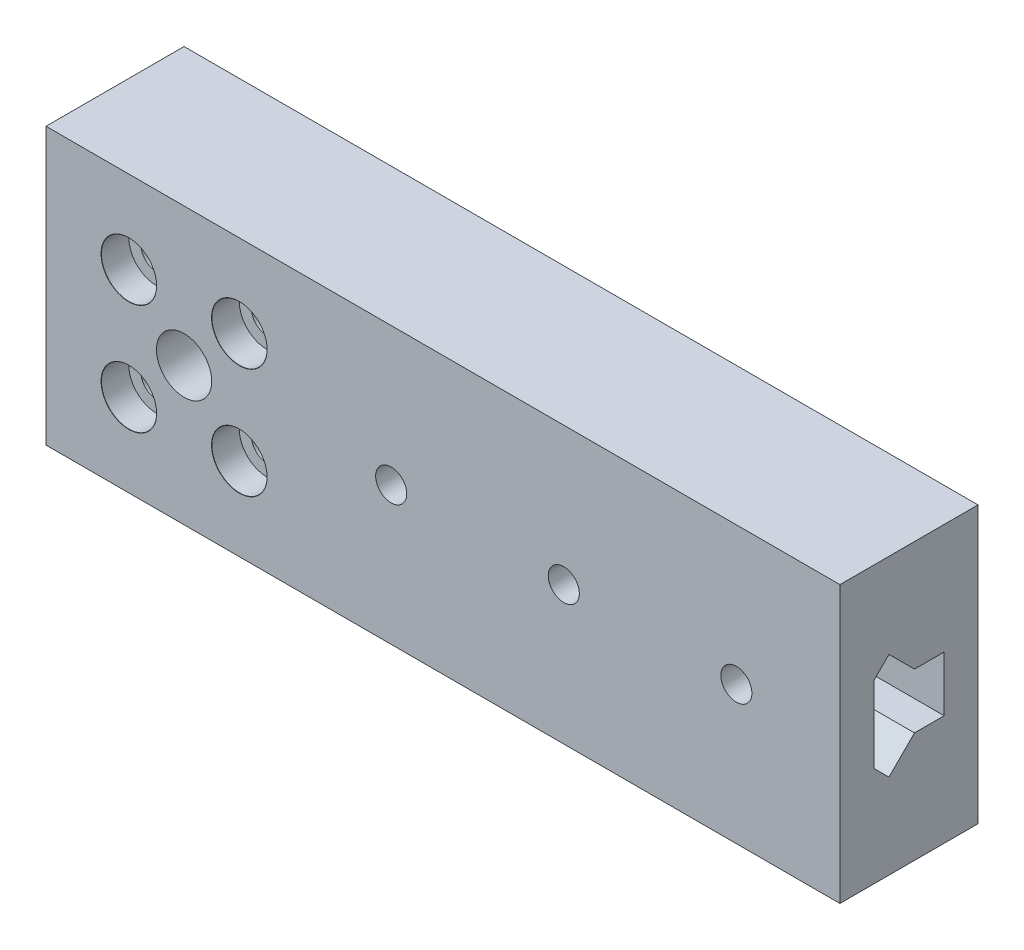
ISO-10303-21;
HEADER;
FILE_DESCRIPTION(('STEP AP214'),'2;1');
FILE_NAME('part.step','',(''),(''),'','','');
FILE_SCHEMA(('AUTOMOTIVE_DESIGN { 1 0 10303 214 1 1 1 1 }'));
ENDSEC;
DATA;
#1=APPLICATION_CONTEXT('core data for automotive mechanical design processes');
#2=APPLICATION_PROTOCOL_DEFINITION('international standard','automotive_design',2000,#1);
#3=PRODUCT_CONTEXT('',#1,'mechanical');
#4=PRODUCT('Part','Part','',(#3));
#5=PRODUCT_RELATED_PRODUCT_CATEGORY('part','',(#4));
#6=PRODUCT_DEFINITION_FORMATION('','',#4);
#7=PRODUCT_DEFINITION_CONTEXT('part definition',#1,'design');
#8=PRODUCT_DEFINITION('design','',#6,#7);
#9=PRODUCT_DEFINITION_SHAPE('','',#8);
#10=(LENGTH_UNIT() NAMED_UNIT(*) SI_UNIT(.MILLI.,.METRE.));
#11=(NAMED_UNIT(*) PLANE_ANGLE_UNIT() SI_UNIT($,.RADIAN.));
#12=(NAMED_UNIT(*) SI_UNIT($,.STERADIAN.) SOLID_ANGLE_UNIT());
#13=UNCERTAINTY_MEASURE_WITH_UNIT(LENGTH_MEASURE(1.E-05),#10,'distance_accuracy_value','');
#14=(GEOMETRIC_REPRESENTATION_CONTEXT(3) GLOBAL_UNCERTAINTY_ASSIGNED_CONTEXT((#13)) GLOBAL_UNIT_ASSIGNED_CONTEXT((#10,
#11,#12)) REPRESENTATION_CONTEXT('',''));
#15=CARTESIAN_POINT('',(0.,0.,0.));
#16=DIRECTION('',(0.,0.,1.));
#17=DIRECTION('',(1.,0.,0.));
#18=AXIS2_PLACEMENT_3D('',#15,#16,#17);
#19=CARTESIAN_POINT('',(75.,-20.,10.));
#20=DIRECTION('',(-1.,0.,0.));
#21=DIRECTION('',(0.,0.,1.));
#22=AXIS2_PLACEMENT_3D('',#19,#20,#21);
#23=PLANE('',#22);
#24=DIRECTION('',(0.,1.,0.));
#25=VECTOR('',#24,1.);
#26=CARTESIAN_POINT('',(75.,-20.,-10.));
#27=LINE('',#26,#25);
#28=CARTESIAN_POINT('',(75.,-20.,-10.));
#29=VERTEX_POINT('',#28);
#30=CARTESIAN_POINT('',(75.,20.,-10.));
#31=VERTEX_POINT('',#30);
#32=EDGE_CURVE('E84',#29,#31,#27,.T.);
#33=ORIENTED_EDGE('',*,*,#32,.T.);
#34=DIRECTION('',(0.,0.,-1.));
#35=VECTOR('',#34,1.);
#36=CARTESIAN_POINT('',(75.,20.,10.));
#37=LINE('',#36,#35);
#38=CARTESIAN_POINT('',(75.,20.,10.));
#39=VERTEX_POINT('',#38);
#40=EDGE_CURVE('E338',#39,#31,#37,.T.);
#41=ORIENTED_EDGE('',*,*,#40,.F.);
#42=DIRECTION('',(0.,1.,0.));
#43=VECTOR('',#42,1.);
#44=CARTESIAN_POINT('',(75.,-20.,10.));
#45=LINE('',#44,#43);
#46=CARTESIAN_POINT('',(75.,-20.,10.));
#47=VERTEX_POINT('',#46);
#48=EDGE_CURVE('E60',#47,#39,#45,.T.);
#49=ORIENTED_EDGE('',*,*,#48,.F.);
#50=DIRECTION('',(0.,0.,-1.));
#51=VECTOR('',#50,1.);
#52=CARTESIAN_POINT('',(75.,-20.,10.));
#53=LINE('',#52,#51);
#54=EDGE_CURVE('E351',#47,#29,#53,.T.);
#55=ORIENTED_EDGE('',*,*,#54,.T.);
#56=EDGE_LOOP('',(#33,#41,#49,#55));
#57=FACE_BOUND('',#56,.T.);
#58=DIRECTION('',(0.,0.707106781186546,0.707106781186549));
#59=VECTOR('',#58,1.);
#60=CARTESIAN_POINT('',(75.,-5.5,5.1));
#61=LINE('',#60,#59);
#62=CARTESIAN_POINT('',(75.,-7.69999999999999,2.9));
#63=VERTEX_POINT('',#62);
#64=CARTESIAN_POINT('',(75.,-5.5,5.1));
#65=VERTEX_POINT('',#64);
#66=EDGE_CURVE('E161',#63,#65,#61,.T.);
#67=ORIENTED_EDGE('',*,*,#66,.T.);
#68=DIRECTION('',(0.,-1.,0.));
#69=VECTOR('',#68,1.);
#70=CARTESIAN_POINT('',(75.,0.,5.1));
#71=LINE('',#70,#69);
#72=CARTESIAN_POINT('',(75.,5.5,5.1));
#73=VERTEX_POINT('',#72);
#74=EDGE_CURVE('E142',#73,#65,#71,.T.);
#75=ORIENTED_EDGE('',*,*,#74,.F.);
#76=DIRECTION('',(0.,-0.707106781186546,0.707106781186549));
#77=VECTOR('',#76,1.);
#78=CARTESIAN_POINT('',(75.,5.5,5.1));
#79=LINE('',#78,#77);
#80=CARTESIAN_POINT('',(75.,7.69999999999999,2.9));
#81=VERTEX_POINT('',#80);
#82=EDGE_CURVE('E154',#81,#73,#79,.T.);
#83=ORIENTED_EDGE('',*,*,#82,.F.);
#84=DIRECTION('',(0.,0.707106781186549,0.707106781186546));
#85=VECTOR('',#84,1.);
#86=CARTESIAN_POINT('',(75.,7.69999999999999,2.9));
#87=LINE('',#86,#85);
#88=CARTESIAN_POINT('',(75.,4.,-0.799999999999975));
#89=VERTEX_POINT('',#88);
#90=EDGE_CURVE('E217',#89,#81,#87,.T.);
#91=ORIENTED_EDGE('',*,*,#90,.F.);
#92=DIRECTION('',(0.,0.,1.));
#93=VECTOR('',#92,1.);
#94=CARTESIAN_POINT('',(75.,4.,-0.799999999999975));
#95=LINE('',#94,#93);
#96=CARTESIAN_POINT('',(75.,4.,-5.1));
#97=VERTEX_POINT('',#96);
#98=EDGE_CURVE('E213',#97,#89,#95,.T.);
#99=ORIENTED_EDGE('',*,*,#98,.F.);
#100=DIRECTION('',(0.,1.,0.));
#101=VECTOR('',#100,1.);
#102=CARTESIAN_POINT('',(75.,4.,-5.1));
#103=LINE('',#102,#101);
#104=CARTESIAN_POINT('',(75.,-4.,-5.1));
#105=VERTEX_POINT('',#104);
#106=EDGE_CURVE('E209',#105,#97,#103,.T.);
#107=ORIENTED_EDGE('',*,*,#106,.F.);
#108=DIRECTION('',(0.,0.,1.));
#109=VECTOR('',#108,1.);
#110=CARTESIAN_POINT('',(75.,-4.,-0.799999999999975));
#111=LINE('',#110,#109);
#112=CARTESIAN_POINT('',(75.,-4.,-0.799999999999975));
#113=VERTEX_POINT('',#112);
#114=EDGE_CURVE('E167',#105,#113,#111,.T.);
#115=ORIENTED_EDGE('',*,*,#114,.T.);
#116=DIRECTION('',(0.,-0.707106781186549,0.707106781186546));
#117=VECTOR('',#116,1.);
#118=CARTESIAN_POINT('',(75.,-7.69999999999999,2.9));
#119=LINE('',#118,#117);
#120=EDGE_CURVE('E171',#113,#63,#119,.T.);
#121=ORIENTED_EDGE('',*,*,#120,.T.);
#122=EDGE_LOOP('',(#67,#75,#83,#91,#99,#107,#115,#121));
#123=FACE_BOUND('',#122,.T.);
#124=ADVANCED_FACE('F41',(#57,#123),#23,.F.);
#125=CARTESIAN_POINT('',(0.,0.,10.));
#126=DIRECTION('',(0.,0.,1.));
#127=DIRECTION('',(1.,0.,0.));
#128=AXIS2_PLACEMENT_3D('',#125,#126,#127);
#129=PLANE('',#128);
#130=CARTESIAN_POINT('',(10.,0.,10.));
#131=DIRECTION('',(0.,0.,-1.));
#132=DIRECTION('',(-1.,0.,0.));
#133=AXIS2_PLACEMENT_3D('',#130,#131,#132);
#134=CIRCLE('',#133,2.25);
#135=CARTESIAN_POINT('',(7.75000000000001,0.,10.));
#136=VERTEX_POINT('',#135);
#137=EDGE_CURVE('E552',#136,#136,#134,.T.);
#138=ORIENTED_EDGE('',*,*,#137,.T.);
#139=EDGE_LOOP('',(#138));
#140=FACE_BOUND('',#139,.T.);
#141=CARTESIAN_POINT('',(35.,0.,10.));
#142=DIRECTION('',(0.,0.,-1.));
#143=DIRECTION('',(-1.,0.,0.));
#144=AXIS2_PLACEMENT_3D('',#141,#142,#143);
#145=CIRCLE('',#144,2.25);
#146=CARTESIAN_POINT('',(32.75,0.,10.));
#147=VERTEX_POINT('',#146);
#148=EDGE_CURVE('E561',#147,#147,#145,.T.);
#149=ORIENTED_EDGE('',*,*,#148,.T.);
#150=EDGE_LOOP('',(#149));
#151=FACE_BOUND('',#150,.T.);
#152=CARTESIAN_POINT('',(60.,0.,10.));
#153=DIRECTION('',(0.,0.,-1.));
#154=DIRECTION('',(-1.,0.,0.));
#155=AXIS2_PLACEMENT_3D('',#152,#153,#154);
#156=CIRCLE('',#155,2.25);
#157=CARTESIAN_POINT('',(57.75,0.,10.));
#158=VERTEX_POINT('',#157);
#159=EDGE_CURVE('E580',#158,#158,#156,.T.);
#160=ORIENTED_EDGE('',*,*,#159,.T.);
#161=EDGE_LOOP('',(#160));
#162=FACE_BOUND('',#161,.T.);
#163=CARTESIAN_POINT('',(-28.,8.,10.));
#164=DIRECTION('',(0.,0.,1.));
#165=DIRECTION('',(1.,0.,0.));
#166=AXIS2_PLACEMENT_3D('',#163,#164,#165);
#167=CIRCLE('',#166,4.025);
#168=CARTESIAN_POINT('',(-23.975,8.,10.));
#169=VERTEX_POINT('',#168);
#170=EDGE_CURVE('E259',#169,#169,#167,.T.);
#171=ORIENTED_EDGE('',*,*,#170,.F.);
#172=EDGE_LOOP('',(#171));
#173=FACE_BOUND('',#172,.T.);
#174=CARTESIAN_POINT('',(-12.,8.,10.));
#175=DIRECTION('',(0.,0.,1.));
#176=DIRECTION('',(1.,0.,0.));
#177=AXIS2_PLACEMENT_3D('',#174,#175,#176);
#178=CIRCLE('',#177,4.025);
#179=CARTESIAN_POINT('',(-7.975,8.,10.));
#180=VERTEX_POINT('',#179);
#181=EDGE_CURVE('E275',#180,#180,#178,.T.);
#182=ORIENTED_EDGE('',*,*,#181,.F.);
#183=EDGE_LOOP('',(#182));
#184=FACE_BOUND('',#183,.T.);
#185=CARTESIAN_POINT('',(-28.,-8.,10.));
#186=DIRECTION('',(0.,0.,1.));
#187=DIRECTION('',(1.,0.,0.));
#188=AXIS2_PLACEMENT_3D('',#185,#186,#187);
#189=CIRCLE('',#188,4.025);
#190=CARTESIAN_POINT('',(-23.975,-8.,10.));
#191=VERTEX_POINT('',#190);
#192=EDGE_CURVE('E291',#191,#191,#189,.T.);
#193=ORIENTED_EDGE('',*,*,#192,.F.);
#194=EDGE_LOOP('',(#193));
#195=FACE_BOUND('',#194,.T.);
#196=CARTESIAN_POINT('',(-12.,-8.,10.));
#197=DIRECTION('',(0.,0.,1.));
#198=DIRECTION('',(1.,0.,0.));
#199=AXIS2_PLACEMENT_3D('',#196,#197,#198);
#200=CIRCLE('',#199,4.025);
#201=CARTESIAN_POINT('',(-7.975,-8.,10.));
#202=VERTEX_POINT('',#201);
#203=EDGE_CURVE('E307',#202,#202,#200,.T.);
#204=ORIENTED_EDGE('',*,*,#203,.F.);
#205=EDGE_LOOP('',(#204));
#206=FACE_BOUND('',#205,.T.);
#207=DIRECTION('',(-1.,0.,0.));
#208=VECTOR('',#207,1.);
#209=CARTESIAN_POINT('',(75.,20.,10.));
#210=LINE('',#209,#208);
#211=CARTESIAN_POINT('',(-40.,20.,10.));
#212=VERTEX_POINT('',#211);
#213=EDGE_CURVE('E328',#39,#212,#210,.T.);
#214=ORIENTED_EDGE('',*,*,#213,.T.);
#215=DIRECTION('',(0.,-1.,0.));
#216=VECTOR('',#215,1.);
#217=CARTESIAN_POINT('',(-40.,20.,10.));
#218=LINE('',#217,#216);
#219=CARTESIAN_POINT('',(-40.,-20.,10.));
#220=VERTEX_POINT('',#219);
#221=EDGE_CURVE('E91',#212,#220,#218,.T.);
#222=ORIENTED_EDGE('',*,*,#221,.T.);
#223=DIRECTION('',(1.,0.,0.));
#224=VECTOR('',#223,1.);
#225=CARTESIAN_POINT('',(-40.,-20.,10.));
#226=LINE('',#225,#224);
#227=EDGE_CURVE('E333',#220,#47,#226,.T.);
#228=ORIENTED_EDGE('',*,*,#227,.T.);
#229=ORIENTED_EDGE('',*,*,#48,.T.);
#230=EDGE_LOOP('',(#214,#222,#228,#229));
#231=FACE_BOUND('',#230,.T.);
#232=CARTESIAN_POINT('',(-20.,0.,10.));
#233=DIRECTION('',(0.,0.,1.));
#234=DIRECTION('',(1.,0.,0.));
#235=AXIS2_PLACEMENT_3D('',#232,#233,#234);
#236=CIRCLE('',#235,4.);
#237=CARTESIAN_POINT('',(-16.,0.,10.));
#238=VERTEX_POINT('',#237);
#239=EDGE_CURVE('E323',#238,#238,#236,.T.);
#240=ORIENTED_EDGE('',*,*,#239,.F.);
#241=EDGE_LOOP('',(#240));
#242=FACE_BOUND('',#241,.T.);
#243=ADVANCED_FACE('F364',(#140,#151,#162,#173,#184,#195,#206,#231,#242),#129,.T.);
#244=CARTESIAN_POINT('',(0.,0.,-10.));
#245=DIRECTION('',(0.,0.,1.));
#246=DIRECTION('',(1.,0.,0.));
#247=AXIS2_PLACEMENT_3D('',#244,#245,#246);
#248=PLANE('',#247);
#249=CARTESIAN_POINT('',(10.,0.,-10.));
#250=DIRECTION('',(0.,0.,-1.));
#251=DIRECTION('',(-1.,0.,0.));
#252=AXIS2_PLACEMENT_3D('',#249,#250,#251);
#253=CIRCLE('',#252,2.25);
#254=CARTESIAN_POINT('',(7.75,0.,-10.));
#255=VERTEX_POINT('',#254);
#256=EDGE_CURVE('E389',#255,#255,#253,.T.);
#257=ORIENTED_EDGE('',*,*,#256,.F.);
#258=EDGE_LOOP('',(#257));
#259=FACE_BOUND('',#258,.T.);
#260=CARTESIAN_POINT('',(35.,0.,-10.));
#261=DIRECTION('',(0.,0.,-1.));
#262=DIRECTION('',(-1.,0.,0.));
#263=AXIS2_PLACEMENT_3D('',#260,#261,#262);
#264=CIRCLE('',#263,2.25);
#265=CARTESIAN_POINT('',(32.75,0.,-10.));
#266=VERTEX_POINT('',#265);
#267=EDGE_CURVE('E393',#266,#266,#264,.T.);
#268=ORIENTED_EDGE('',*,*,#267,.F.);
#269=EDGE_LOOP('',(#268));
#270=FACE_BOUND('',#269,.T.);
#271=CARTESIAN_POINT('',(60.,0.,-10.));
#272=DIRECTION('',(0.,0.,-1.));
#273=DIRECTION('',(-1.,0.,0.));
#274=AXIS2_PLACEMENT_3D('',#271,#272,#273);
#275=CIRCLE('',#274,2.25);
#276=CARTESIAN_POINT('',(57.75,0.,-10.));
#277=VERTEX_POINT('',#276);
#278=EDGE_CURVE('E397',#277,#277,#275,.T.);
#279=ORIENTED_EDGE('',*,*,#278,.F.);
#280=EDGE_LOOP('',(#279));
#281=FACE_BOUND('',#280,.T.);
#282=CARTESIAN_POINT('',(-20.,0.,-10.));
#283=DIRECTION('',(0.,0.,-1.));
#284=DIRECTION('',(-1.,0.,0.));
#285=AXIS2_PLACEMENT_3D('',#282,#283,#284);
#286=CIRCLE('',#285,16.5);
#287=CARTESIAN_POINT('',(-36.5,0.,-10.));
#288=VERTEX_POINT('',#287);
#289=EDGE_CURVE('E236',#288,#288,#286,.T.);
#290=ORIENTED_EDGE('',*,*,#289,.F.);
#291=EDGE_LOOP('',(#290));
#292=FACE_BOUND('',#291,.T.);
#293=DIRECTION('',(-1.,0.,0.));
#294=VECTOR('',#293,1.);
#295=CARTESIAN_POINT('',(75.,20.,-10.));
#296=LINE('',#295,#294);
#297=CARTESIAN_POINT('',(-40.,20.,-10.));
#298=VERTEX_POINT('',#297);
#299=EDGE_CURVE('E327',#31,#298,#296,.T.);
#300=ORIENTED_EDGE('',*,*,#299,.F.);
#301=ORIENTED_EDGE('',*,*,#32,.F.);
#302=DIRECTION('',(1.,0.,0.));
#303=VECTOR('',#302,1.);
#304=CARTESIAN_POINT('',(-40.,-20.,-10.));
#305=LINE('',#304,#303);
#306=CARTESIAN_POINT('',(-40.,-20.,-10.));
#307=VERTEX_POINT('',#306);
#308=EDGE_CURVE('E78',#307,#29,#305,.T.);
#309=ORIENTED_EDGE('',*,*,#308,.F.);
#310=DIRECTION('',(0.,-1.,0.));
#311=VECTOR('',#310,1.);
#312=CARTESIAN_POINT('',(-40.,20.,-10.));
#313=LINE('',#312,#311);
#314=EDGE_CURVE('E342',#298,#307,#313,.T.);
#315=ORIENTED_EDGE('',*,*,#314,.F.);
#316=EDGE_LOOP('',(#300,#301,#309,#315));
#317=FACE_BOUND('',#316,.T.);
#318=ADVANCED_FACE('F359',(#259,#270,#281,#292,#317),#248,.F.);
#319=CARTESIAN_POINT('',(75.,20.,10.));
#320=DIRECTION('',(0.,-1.,0.));
#321=DIRECTION('',(0.,0.,-1.));
#322=AXIS2_PLACEMENT_3D('',#319,#320,#321);
#323=PLANE('',#322);
#324=ORIENTED_EDGE('',*,*,#299,.T.);
#325=DIRECTION('',(0.,0.,-1.));
#326=VECTOR('',#325,1.);
#327=CARTESIAN_POINT('',(-40.,20.,10.));
#328=LINE('',#327,#326);
#329=EDGE_CURVE('E12',#212,#298,#328,.T.);
#330=ORIENTED_EDGE('',*,*,#329,.F.);
#331=ORIENTED_EDGE('',*,*,#213,.F.);
#332=ORIENTED_EDGE('',*,*,#40,.T.);
#333=EDGE_LOOP('',(#324,#330,#331,#332));
#334=FACE_BOUND('',#333,.T.);
#335=ADVANCED_FACE('F43',(#334),#323,.F.);
#336=CARTESIAN_POINT('',(-40.,20.,10.));
#337=DIRECTION('',(1.,0.,0.));
#338=DIRECTION('',(0.,0.,-1.));
#339=AXIS2_PLACEMENT_3D('',#336,#337,#338);
#340=PLANE('',#339);
#341=ORIENTED_EDGE('',*,*,#314,.T.);
#342=DIRECTION('',(0.,0.,-1.));
#343=VECTOR('',#342,1.);
#344=CARTESIAN_POINT('',(-40.,-20.,10.));
#345=LINE('',#344,#343);
#346=EDGE_CURVE('E52',#220,#307,#345,.T.);
#347=ORIENTED_EDGE('',*,*,#346,.F.);
#348=ORIENTED_EDGE('',*,*,#221,.F.);
#349=ORIENTED_EDGE('',*,*,#329,.T.);
#350=EDGE_LOOP('',(#341,#347,#348,#349));
#351=FACE_BOUND('',#350,.T.);
#352=ADVANCED_FACE('F375',(#351),#340,.F.);
#353=CARTESIAN_POINT('',(-40.,-20.,10.));
#354=DIRECTION('',(0.,1.,0.));
#355=DIRECTION('',(0.,0.,1.));
#356=AXIS2_PLACEMENT_3D('',#353,#354,#355);
#357=PLANE('',#356);
#358=ORIENTED_EDGE('',*,*,#308,.T.);
#359=ORIENTED_EDGE('',*,*,#54,.F.);
#360=ORIENTED_EDGE('',*,*,#227,.F.);
#361=ORIENTED_EDGE('',*,*,#346,.T.);
#362=EDGE_LOOP('',(#358,#359,#360,#361));
#363=FACE_BOUND('',#362,.T.);
#364=ADVANCED_FACE('F356',(#363),#357,.F.);
#365=CARTESIAN_POINT('',(-20.,0.,10.));
#366=DIRECTION('',(0.,0.,-1.));
#367=DIRECTION('',(-1.,0.,0.));
#368=AXIS2_PLACEMENT_3D('',#365,#366,#367);
#369=CYLINDRICAL_SURFACE('',#368,4.);
#370=CARTESIAN_POINT('',(-20.,0.,2.));
#371=DIRECTION('',(0.,0.,1.));
#372=DIRECTION('',(1.,0.,0.));
#373=AXIS2_PLACEMENT_3D('',#370,#371,#372);
#374=CIRCLE('',#373,4.);
#375=CARTESIAN_POINT('',(-16.,0.,2.));
#376=VERTEX_POINT('',#375);
#377=EDGE_CURVE('E240',#376,#376,#374,.F.);
#378=ORIENTED_EDGE('',*,*,#377,.T.);
#379=EDGE_LOOP('',(#378));
#380=FACE_BOUND('',#379,.T.);
#381=ORIENTED_EDGE('',*,*,#239,.T.);
#382=EDGE_LOOP('',(#381));
#383=FACE_BOUND('',#382,.T.);
#384=ADVANCED_FACE('F374',(#380,#383),#369,.F.);
#385=CARTESIAN_POINT('',(-12.,-8.,10.));
#386=DIRECTION('',(0.,0.,1.));
#387=DIRECTION('',(1.,0.,0.));
#388=AXIS2_PLACEMENT_3D('',#385,#386,#387);
#389=CYLINDRICAL_SURFACE('',#388,2.25);
#390=CARTESIAN_POINT('',(-12.,-8.,2.));
#391=DIRECTION('',(0.,0.,1.));
#392=DIRECTION('',(1.,0.,0.));
#393=AXIS2_PLACEMENT_3D('',#390,#391,#392);
#394=CIRCLE('',#393,2.25);
#395=CARTESIAN_POINT('',(-9.75,-8.,2.));
#396=VERTEX_POINT('',#395);
#397=EDGE_CURVE('E255',#396,#396,#394,.F.);
#398=ORIENTED_EDGE('',*,*,#397,.T.);
#399=EDGE_LOOP('',(#398));
#400=FACE_BOUND('',#399,.T.);
#401=CARTESIAN_POINT('',(-12.,-8.,6.));
#402=DIRECTION('',(0.,0.,1.));
#403=DIRECTION('',(1.,0.,0.));
#404=AXIS2_PLACEMENT_3D('',#401,#402,#403);
#405=CIRCLE('',#404,2.25);
#406=CARTESIAN_POINT('',(-9.74999999999999,-8.,6.));
#407=VERTEX_POINT('',#406);
#408=EDGE_CURVE('E319',#407,#407,#405,.T.);
#409=ORIENTED_EDGE('',*,*,#408,.T.);
#410=EDGE_LOOP('',(#409));
#411=FACE_BOUND('',#410,.T.);
#412=ADVANCED_FACE('F418',(#400,#411),#389,.F.);
#413=CARTESIAN_POINT('',(-8.,-8.,6.));
#414=DIRECTION('',(0.,0.,-1.));
#415=DIRECTION('',(-1.,0.,0.));
#416=AXIS2_PLACEMENT_3D('',#413,#414,#415);
#417=PLANE('',#416);
#418=ORIENTED_EDGE('',*,*,#408,.F.);
#419=EDGE_LOOP('',(#418));
#420=FACE_BOUND('',#419,.T.);
#421=CARTESIAN_POINT('',(-12.,-8.,6.));
#422=DIRECTION('',(0.,0.,1.));
#423=DIRECTION('',(1.,0.,0.));
#424=AXIS2_PLACEMENT_3D('',#421,#422,#423);
#425=CIRCLE('',#424,4.);
#426=CARTESIAN_POINT('',(-8.,-8.,6.));
#427=VERTEX_POINT('',#426);
#428=EDGE_CURVE('E315',#427,#427,#425,.T.);
#429=ORIENTED_EDGE('',*,*,#428,.T.);
#430=EDGE_LOOP('',(#429));
#431=FACE_BOUND('',#430,.T.);
#432=ADVANCED_FACE('F421',(#420,#431),#417,.F.);
#433=CARTESIAN_POINT('',(-12.,-8.,10.));
#434=DIRECTION('',(0.,0.,1.));
#435=DIRECTION('',(1.,0.,0.));
#436=AXIS2_PLACEMENT_3D('',#433,#434,#435);
#437=CYLINDRICAL_SURFACE('',#436,4.);
#438=ORIENTED_EDGE('',*,*,#428,.F.);
#439=EDGE_LOOP('',(#438));
#440=FACE_BOUND('',#439,.T.);
#441=CARTESIAN_POINT('',(-12.,-8.,9.975));
#442=DIRECTION('',(0.,0.,1.));
#443=DIRECTION('',(1.,0.,0.));
#444=AXIS2_PLACEMENT_3D('',#441,#442,#443);
#445=CIRCLE('',#444,4.);
#446=CARTESIAN_POINT('',(-8.,-8.,9.975));
#447=VERTEX_POINT('',#446);
#448=EDGE_CURVE('E311',#447,#447,#445,.T.);
#449=ORIENTED_EDGE('',*,*,#448,.T.);
#450=EDGE_LOOP('',(#449));
#451=FACE_BOUND('',#450,.T.);
#452=ADVANCED_FACE('F427',(#440,#451),#437,.F.);
#453=CARTESIAN_POINT('',(-12.,-8.,10.));
#454=DIRECTION('',(0.,0.,1.));
#455=DIRECTION('',(1.,0.,0.));
#456=AXIS2_PLACEMENT_3D('',#453,#454,#455);
#457=CONICAL_SURFACE('',#456,4.025,0.785398163397448);
#458=ORIENTED_EDGE('',*,*,#448,.F.);
#459=EDGE_LOOP('',(#458));
#460=FACE_BOUND('',#459,.T.);
#461=ORIENTED_EDGE('',*,*,#203,.T.);
#462=EDGE_LOOP('',(#461));
#463=FACE_BOUND('',#462,.T.);
#464=ADVANCED_FACE('F433',(#460,#463),#457,.F.);
#465=CARTESIAN_POINT('',(-28.,-8.,10.));
#466=DIRECTION('',(0.,0.,1.));
#467=DIRECTION('',(1.,0.,0.));
#468=AXIS2_PLACEMENT_3D('',#465,#466,#467);
#469=CYLINDRICAL_SURFACE('',#468,2.25);
#470=CARTESIAN_POINT('',(-28.,-8.,2.));
#471=DIRECTION('',(0.,0.,1.));
#472=DIRECTION('',(1.,0.,0.));
#473=AXIS2_PLACEMENT_3D('',#470,#471,#472);
#474=CIRCLE('',#473,2.25);
#475=CARTESIAN_POINT('',(-25.75,-8.,2.));
#476=VERTEX_POINT('',#475);
#477=EDGE_CURVE('E251',#476,#476,#474,.F.);
#478=ORIENTED_EDGE('',*,*,#477,.T.);
#479=EDGE_LOOP('',(#478));
#480=FACE_BOUND('',#479,.T.);
#481=CARTESIAN_POINT('',(-28.,-8.,6.));
#482=DIRECTION('',(0.,0.,1.));
#483=DIRECTION('',(1.,0.,0.));
#484=AXIS2_PLACEMENT_3D('',#481,#482,#483);
#485=CIRCLE('',#484,2.25);
#486=CARTESIAN_POINT('',(-25.75,-8.,6.));
#487=VERTEX_POINT('',#486);
#488=EDGE_CURVE('E303',#487,#487,#485,.T.);
#489=ORIENTED_EDGE('',*,*,#488,.T.);
#490=EDGE_LOOP('',(#489));
#491=FACE_BOUND('',#490,.T.);
#492=ADVANCED_FACE('F439',(#480,#491),#469,.F.);
#493=CARTESIAN_POINT('',(-24.,-8.,6.));
#494=DIRECTION('',(0.,0.,-1.));
#495=DIRECTION('',(-1.,0.,0.));
#496=AXIS2_PLACEMENT_3D('',#493,#494,#495);
#497=PLANE('',#496);
#498=ORIENTED_EDGE('',*,*,#488,.F.);
#499=EDGE_LOOP('',(#498));
#500=FACE_BOUND('',#499,.T.);
#501=CARTESIAN_POINT('',(-28.,-8.,6.));
#502=DIRECTION('',(0.,0.,1.));
#503=DIRECTION('',(1.,0.,0.));
#504=AXIS2_PLACEMENT_3D('',#501,#502,#503);
#505=CIRCLE('',#504,4.);
#506=CARTESIAN_POINT('',(-24.,-8.,6.));
#507=VERTEX_POINT('',#506);
#508=EDGE_CURVE('E299',#507,#507,#505,.T.);
#509=ORIENTED_EDGE('',*,*,#508,.T.);
#510=EDGE_LOOP('',(#509));
#511=FACE_BOUND('',#510,.T.);
#512=ADVANCED_FACE('F454',(#500,#511),#497,.F.);
#513=CARTESIAN_POINT('',(-28.,-8.,10.));
#514=DIRECTION('',(0.,0.,1.));
#515=DIRECTION('',(1.,0.,0.));
#516=AXIS2_PLACEMENT_3D('',#513,#514,#515);
#517=CYLINDRICAL_SURFACE('',#516,4.);
#518=ORIENTED_EDGE('',*,*,#508,.F.);
#519=EDGE_LOOP('',(#518));
#520=FACE_BOUND('',#519,.T.);
#521=CARTESIAN_POINT('',(-28.,-8.,9.975));
#522=DIRECTION('',(0.,0.,1.));
#523=DIRECTION('',(1.,0.,0.));
#524=AXIS2_PLACEMENT_3D('',#521,#522,#523);
#525=CIRCLE('',#524,4.);
#526=CARTESIAN_POINT('',(-24.,-8.,9.975));
#527=VERTEX_POINT('',#526);
#528=EDGE_CURVE('E295',#527,#527,#525,.T.);
#529=ORIENTED_EDGE('',*,*,#528,.T.);
#530=EDGE_LOOP('',(#529));
#531=FACE_BOUND('',#530,.T.);
#532=ADVANCED_FACE('F458',(#520,#531),#517,.F.);
#533=CARTESIAN_POINT('',(-28.,-8.,10.));
#534=DIRECTION('',(0.,0.,1.));
#535=DIRECTION('',(1.,0.,0.));
#536=AXIS2_PLACEMENT_3D('',#533,#534,#535);
#537=CONICAL_SURFACE('',#536,4.025,0.785398163397483);
#538=ORIENTED_EDGE('',*,*,#528,.F.);
#539=EDGE_LOOP('',(#538));
#540=FACE_BOUND('',#539,.T.);
#541=ORIENTED_EDGE('',*,*,#192,.T.);
#542=EDGE_LOOP('',(#541));
#543=FACE_BOUND('',#542,.T.);
#544=ADVANCED_FACE('F462',(#540,#543),#537,.F.);
#545=CARTESIAN_POINT('',(-12.,8.,10.));
#546=DIRECTION('',(0.,0.,1.));
#547=DIRECTION('',(1.,0.,0.));
#548=AXIS2_PLACEMENT_3D('',#545,#546,#547);
#549=CYLINDRICAL_SURFACE('',#548,2.25);
#550=CARTESIAN_POINT('',(-12.,8.,2.));
#551=DIRECTION('',(0.,0.,1.));
#552=DIRECTION('',(1.,0.,0.));
#553=AXIS2_PLACEMENT_3D('',#550,#551,#552);
#554=CIRCLE('',#553,2.25);
#555=CARTESIAN_POINT('',(-9.75,8.,2.));
#556=VERTEX_POINT('',#555);
#557=EDGE_CURVE('E247',#556,#556,#554,.F.);
#558=ORIENTED_EDGE('',*,*,#557,.T.);
#559=EDGE_LOOP('',(#558));
#560=FACE_BOUND('',#559,.T.);
#561=CARTESIAN_POINT('',(-12.,8.,6.));
#562=DIRECTION('',(0.,0.,1.));
#563=DIRECTION('',(1.,0.,0.));
#564=AXIS2_PLACEMENT_3D('',#561,#562,#563);
#565=CIRCLE('',#564,2.25);
#566=CARTESIAN_POINT('',(-9.74999999999999,8.,6.));
#567=VERTEX_POINT('',#566);
#568=EDGE_CURVE('E287',#567,#567,#565,.T.);
#569=ORIENTED_EDGE('',*,*,#568,.T.);
#570=EDGE_LOOP('',(#569));
#571=FACE_BOUND('',#570,.T.);
#572=ADVANCED_FACE('F466',(#560,#571),#549,.F.);
#573=CARTESIAN_POINT('',(-8.,8.,6.));
#574=DIRECTION('',(0.,0.,-1.));
#575=DIRECTION('',(-1.,0.,0.));
#576=AXIS2_PLACEMENT_3D('',#573,#574,#575);
#577=PLANE('',#576);
#578=ORIENTED_EDGE('',*,*,#568,.F.);
#579=EDGE_LOOP('',(#578));
#580=FACE_BOUND('',#579,.T.);
#581=CARTESIAN_POINT('',(-12.,8.,6.));
#582=DIRECTION('',(0.,0.,1.));
#583=DIRECTION('',(1.,0.,0.));
#584=AXIS2_PLACEMENT_3D('',#581,#582,#583);
#585=CIRCLE('',#584,4.);
#586=CARTESIAN_POINT('',(-8.,8.,6.));
#587=VERTEX_POINT('',#586);
#588=EDGE_CURVE('E283',#587,#587,#585,.T.);
#589=ORIENTED_EDGE('',*,*,#588,.T.);
#590=EDGE_LOOP('',(#589));
#591=FACE_BOUND('',#590,.T.);
#592=ADVANCED_FACE('F470',(#580,#591),#577,.F.);
#593=CARTESIAN_POINT('',(-12.,8.,10.));
#594=DIRECTION('',(0.,0.,1.));
#595=DIRECTION('',(1.,0.,0.));
#596=AXIS2_PLACEMENT_3D('',#593,#594,#595);
#597=CYLINDRICAL_SURFACE('',#596,4.);
#598=ORIENTED_EDGE('',*,*,#588,.F.);
#599=EDGE_LOOP('',(#598));
#600=FACE_BOUND('',#599,.T.);
#601=CARTESIAN_POINT('',(-12.,8.,9.975));
#602=DIRECTION('',(0.,0.,1.));
#603=DIRECTION('',(1.,0.,0.));
#604=AXIS2_PLACEMENT_3D('',#601,#602,#603);
#605=CIRCLE('',#604,4.);
#606=CARTESIAN_POINT('',(-8.,8.,9.975));
#607=VERTEX_POINT('',#606);
#608=EDGE_CURVE('E279',#607,#607,#605,.T.);
#609=ORIENTED_EDGE('',*,*,#608,.T.);
#610=EDGE_LOOP('',(#609));
#611=FACE_BOUND('',#610,.T.);
#612=ADVANCED_FACE('F474',(#600,#611),#597,.F.);
#613=CARTESIAN_POINT('',(-12.,8.,10.));
#614=DIRECTION('',(0.,0.,1.));
#615=DIRECTION('',(1.,0.,0.));
#616=AXIS2_PLACEMENT_3D('',#613,#614,#615);
#617=CONICAL_SURFACE('',#616,4.025,0.785398163397448);
#618=ORIENTED_EDGE('',*,*,#608,.F.);
#619=EDGE_LOOP('',(#618));
#620=FACE_BOUND('',#619,.T.);
#621=ORIENTED_EDGE('',*,*,#181,.T.);
#622=EDGE_LOOP('',(#621));
#623=FACE_BOUND('',#622,.T.);
#624=ADVANCED_FACE('F478',(#620,#623),#617,.F.);
#625=CARTESIAN_POINT('',(-28.,8.,10.));
#626=DIRECTION('',(0.,0.,1.));
#627=DIRECTION('',(1.,0.,0.));
#628=AXIS2_PLACEMENT_3D('',#625,#626,#627);
#629=CYLINDRICAL_SURFACE('',#628,2.25);
#630=CARTESIAN_POINT('',(-28.,8.,2.));
#631=DIRECTION('',(0.,0.,1.));
#632=DIRECTION('',(1.,0.,0.));
#633=AXIS2_PLACEMENT_3D('',#630,#631,#632);
#634=CIRCLE('',#633,2.25);
#635=CARTESIAN_POINT('',(-25.75,8.,2.));
#636=VERTEX_POINT('',#635);
#637=EDGE_CURVE('E45',#636,#636,#634,.F.);
#638=ORIENTED_EDGE('',*,*,#637,.T.);
#639=EDGE_LOOP('',(#638));
#640=FACE_BOUND('',#639,.T.);
#641=CARTESIAN_POINT('',(-28.,8.,6.));
#642=DIRECTION('',(0.,0.,1.));
#643=DIRECTION('',(1.,0.,0.));
#644=AXIS2_PLACEMENT_3D('',#641,#642,#643);
#645=CIRCLE('',#644,2.25);
#646=CARTESIAN_POINT('',(-25.75,8.,6.));
#647=VERTEX_POINT('',#646);
#648=EDGE_CURVE('E271',#647,#647,#645,.T.);
#649=ORIENTED_EDGE('',*,*,#648,.T.);
#650=EDGE_LOOP('',(#649));
#651=FACE_BOUND('',#650,.T.);
#652=ADVANCED_FACE('F482',(#640,#651),#629,.F.);
#653=CARTESIAN_POINT('',(-24.,8.,6.));
#654=DIRECTION('',(0.,0.,-1.));
#655=DIRECTION('',(-1.,0.,0.));
#656=AXIS2_PLACEMENT_3D('',#653,#654,#655);
#657=PLANE('',#656);
#658=ORIENTED_EDGE('',*,*,#648,.F.);
#659=EDGE_LOOP('',(#658));
#660=FACE_BOUND('',#659,.T.);
#661=CARTESIAN_POINT('',(-28.,8.,6.));
#662=DIRECTION('',(0.,0.,1.));
#663=DIRECTION('',(1.,0.,0.));
#664=AXIS2_PLACEMENT_3D('',#661,#662,#663);
#665=CIRCLE('',#664,4.);
#666=CARTESIAN_POINT('',(-24.,8.,6.));
#667=VERTEX_POINT('',#666);
#668=EDGE_CURVE('E267',#667,#667,#665,.T.);
#669=ORIENTED_EDGE('',*,*,#668,.T.);
#670=EDGE_LOOP('',(#669));
#671=FACE_BOUND('',#670,.T.);
#672=ADVANCED_FACE('F486',(#660,#671),#657,.F.);
#673=CARTESIAN_POINT('',(-28.,8.,10.));
#674=DIRECTION('',(0.,0.,1.));
#675=DIRECTION('',(1.,0.,0.));
#676=AXIS2_PLACEMENT_3D('',#673,#674,#675);
#677=CYLINDRICAL_SURFACE('',#676,4.);
#678=ORIENTED_EDGE('',*,*,#668,.F.);
#679=EDGE_LOOP('',(#678));
#680=FACE_BOUND('',#679,.T.);
#681=CARTESIAN_POINT('',(-28.,8.,9.975));
#682=DIRECTION('',(0.,0.,1.));
#683=DIRECTION('',(1.,0.,0.));
#684=AXIS2_PLACEMENT_3D('',#681,#682,#683);
#685=CIRCLE('',#684,4.);
#686=CARTESIAN_POINT('',(-24.,8.,9.975));
#687=VERTEX_POINT('',#686);
#688=EDGE_CURVE('E263',#687,#687,#685,.T.);
#689=ORIENTED_EDGE('',*,*,#688,.T.);
#690=EDGE_LOOP('',(#689));
#691=FACE_BOUND('',#690,.T.);
#692=ADVANCED_FACE('F490',(#680,#691),#677,.F.);
#693=CARTESIAN_POINT('',(-28.,8.,10.));
#694=DIRECTION('',(0.,0.,1.));
#695=DIRECTION('',(1.,0.,0.));
#696=AXIS2_PLACEMENT_3D('',#693,#694,#695);
#697=CONICAL_SURFACE('',#696,4.025,0.785398163397483);
#698=ORIENTED_EDGE('',*,*,#688,.F.);
#699=EDGE_LOOP('',(#698));
#700=FACE_BOUND('',#699,.T.);
#701=ORIENTED_EDGE('',*,*,#170,.T.);
#702=EDGE_LOOP('',(#701));
#703=FACE_BOUND('',#702,.T.);
#704=ADVANCED_FACE('F409',(#700,#703),#697,.F.);
#705=CARTESIAN_POINT('',(0.,0.,2.));
#706=DIRECTION('',(0.,0.,1.));
#707=DIRECTION('',(1.,0.,0.));
#708=AXIS2_PLACEMENT_3D('',#705,#706,#707);
#709=PLANE('',#708);
#710=ORIENTED_EDGE('',*,*,#477,.F.);
#711=EDGE_LOOP('',(#710));
#712=FACE_BOUND('',#711,.T.);
#713=ORIENTED_EDGE('',*,*,#637,.F.);
#714=EDGE_LOOP('',(#713));
#715=FACE_BOUND('',#714,.T.);
#716=CARTESIAN_POINT('',(-20.,0.,2.));
#717=DIRECTION('',(0.,0.,1.));
#718=DIRECTION('',(1.,0.,0.));
#719=AXIS2_PLACEMENT_3D('',#716,#717,#718);
#720=CIRCLE('',#719,16.5);
#721=CARTESIAN_POINT('',(-3.5,0.,2.));
#722=VERTEX_POINT('',#721);
#723=EDGE_CURVE('E235',#722,#722,#720,.F.);
#724=ORIENTED_EDGE('',*,*,#723,.T.);
#725=EDGE_LOOP('',(#724));
#726=FACE_BOUND('',#725,.T.);
#727=ORIENTED_EDGE('',*,*,#377,.F.);
#728=EDGE_LOOP('',(#727));
#729=FACE_BOUND('',#728,.T.);
#730=ORIENTED_EDGE('',*,*,#557,.F.);
#731=EDGE_LOOP('',(#730));
#732=FACE_BOUND('',#731,.T.);
#733=ORIENTED_EDGE('',*,*,#397,.F.);
#734=EDGE_LOOP('',(#733));
#735=FACE_BOUND('',#734,.T.);
#736=ADVANCED_FACE('F403',(#712,#715,#726,#729,#732,#735),#709,.F.);
#737=CARTESIAN_POINT('',(-20.,0.,56.6690475583121));
#738=DIRECTION('',(0.,0.,-1.));
#739=DIRECTION('',(-1.,0.,0.));
#740=AXIS2_PLACEMENT_3D('',#737,#738,#739);
#741=CYLINDRICAL_SURFACE('',#740,16.5);
#742=ORIENTED_EDGE('',*,*,#289,.T.);
#743=EDGE_LOOP('',(#742));
#744=FACE_BOUND('',#743,.T.);
#745=ORIENTED_EDGE('',*,*,#723,.F.);
#746=EDGE_LOOP('',(#745));
#747=FACE_BOUND('',#746,.T.);
#748=ADVANCED_FACE('F400',(#744,#747),#741,.F.);
#749=CARTESIAN_POINT('',(-12.7800625976558,0.,5.1));
#750=DIRECTION('',(0.,0.,1.));
#751=DIRECTION('',(0.,-1.,0.));
#752=AXIS2_PLACEMENT_3D('',#749,#750,#751);
#753=PLANE('',#752);
#754=CARTESIAN_POINT('',(10.,0.,5.1));
#755=DIRECTION('',(0.,0.,1.));
#756=DIRECTION('',(0.,-1.,0.));
#757=AXIS2_PLACEMENT_3D('',#754,#755,#756);
#758=CIRCLE('',#757,2.25);
#759=CARTESIAN_POINT('',(10.,-2.25,5.1));
#760=VERTEX_POINT('',#759);
#761=EDGE_CURVE('E555',#760,#760,#758,.T.);
#762=ORIENTED_EDGE('',*,*,#761,.T.);
#763=EDGE_LOOP('',(#762));
#764=FACE_BOUND('',#763,.T.);
#765=CARTESIAN_POINT('',(35.,0.,5.1));
#766=DIRECTION('',(0.,0.,1.));
#767=DIRECTION('',(0.,-1.,0.));
#768=AXIS2_PLACEMENT_3D('',#765,#766,#767);
#769=CIRCLE('',#768,2.25);
#770=CARTESIAN_POINT('',(35.,-2.25,5.1));
#771=VERTEX_POINT('',#770);
#772=EDGE_CURVE('E574',#771,#771,#769,.T.);
#773=ORIENTED_EDGE('',*,*,#772,.T.);
#774=EDGE_LOOP('',(#773));
#775=FACE_BOUND('',#774,.T.);
#776=CARTESIAN_POINT('',(60.,0.,5.1));
#777=DIRECTION('',(0.,0.,1.));
#778=DIRECTION('',(0.,-1.,0.));
#779=AXIS2_PLACEMENT_3D('',#776,#777,#778);
#780=CIRCLE('',#779,2.25);
#781=CARTESIAN_POINT('',(60.,-2.25,5.1));
#782=VERTEX_POINT('',#781);
#783=EDGE_CURVE('E173',#782,#782,#780,.T.);
#784=ORIENTED_EDGE('',*,*,#783,.T.);
#785=EDGE_LOOP('',(#784));
#786=FACE_BOUND('',#785,.T.);
#787=DIRECTION('',(0.,1.,0.));
#788=VECTOR('',#787,1.);
#789=CARTESIAN_POINT('',(0.,0.,5.1));
#790=LINE('',#789,#788);
#791=CARTESIAN_POINT('',(0.,-5.5,5.1));
#792=VERTEX_POINT('',#791);
#793=CARTESIAN_POINT('',(0.,5.5,5.1));
#794=VERTEX_POINT('',#793);
#795=EDGE_CURVE('E205',#792,#794,#790,.T.);
#796=ORIENTED_EDGE('',*,*,#795,.T.);
#797=DIRECTION('',(1.,0.,0.));
#798=VECTOR('',#797,1.);
#799=CARTESIAN_POINT('',(-12.7800625976558,5.5,5.1));
#800=LINE('',#799,#798);
#801=EDGE_CURVE('E147',#794,#73,#800,.T.);
#802=ORIENTED_EDGE('',*,*,#801,.T.);
#803=ORIENTED_EDGE('',*,*,#74,.T.);
#804=DIRECTION('',(1.,0.,0.));
#805=VECTOR('',#804,1.);
#806=CARTESIAN_POINT('',(-12.7800625976558,-5.5,5.1));
#807=LINE('',#806,#805);
#808=EDGE_CURVE('E145',#792,#65,#807,.T.);
#809=ORIENTED_EDGE('',*,*,#808,.F.);
#810=EDGE_LOOP('',(#796,#802,#803,#809));
#811=FACE_BOUND('',#810,.T.);
#812=ADVANCED_FACE('F144',(#764,#775,#786,#811),#753,.F.);
#813=CARTESIAN_POINT('',(-12.7800625976558,5.5,5.1));
#814=DIRECTION('',(0.,0.707106781186549,0.707106781186546));
#815=DIRECTION('',(0.,-0.707106781186546,0.707106781186549));
#816=AXIS2_PLACEMENT_3D('',#813,#814,#815);
#817=PLANE('',#816);
#818=DIRECTION('',(0.,0.707106781186546,-0.707106781186549));
#819=VECTOR('',#818,1.);
#820=CARTESIAN_POINT('',(0.,5.5,5.1));
#821=LINE('',#820,#819);
#822=CARTESIAN_POINT('',(0.,7.69999999999999,2.9));
#823=VERTEX_POINT('',#822);
#824=EDGE_CURVE('E202',#794,#823,#821,.T.);
#825=ORIENTED_EDGE('',*,*,#824,.T.);
#826=DIRECTION('',(1.,0.,0.));
#827=VECTOR('',#826,1.);
#828=CARTESIAN_POINT('',(-12.7800625976558,7.69999999999999,2.9));
#829=LINE('',#828,#827);
#830=EDGE_CURVE('E225',#823,#81,#829,.T.);
#831=ORIENTED_EDGE('',*,*,#830,.T.);
#832=ORIENTED_EDGE('',*,*,#82,.T.);
#833=ORIENTED_EDGE('',*,*,#801,.F.);
#834=EDGE_LOOP('',(#825,#831,#832,#833));
#835=FACE_BOUND('',#834,.T.);
#836=ADVANCED_FACE('F510',(#835),#817,.F.);
#837=CARTESIAN_POINT('',(-12.7800625976558,7.69999999999999,2.9));
#838=DIRECTION('',(0.,0.707106781186546,-0.707106781186549));
#839=DIRECTION('',(0.,0.707106781186549,0.707106781186546));
#840=AXIS2_PLACEMENT_3D('',#837,#838,#839);
#841=PLANE('',#840);
#842=DIRECTION('',(0.,-0.707106781186549,-0.707106781186546));
#843=VECTOR('',#842,1.);
#844=CARTESIAN_POINT('',(0.,7.69999999999999,2.9));
#845=LINE('',#844,#843);
#846=CARTESIAN_POINT('',(0.,4.,-0.799999999999975));
#847=VERTEX_POINT('',#846);
#848=EDGE_CURVE('E199',#823,#847,#845,.T.);
#849=ORIENTED_EDGE('',*,*,#848,.T.);
#850=DIRECTION('',(1.,0.,0.));
#851=VECTOR('',#850,1.);
#852=CARTESIAN_POINT('',(-12.7800625976558,4.,-0.799999999999975));
#853=LINE('',#852,#851);
#854=EDGE_CURVE('E228',#847,#89,#853,.T.);
#855=ORIENTED_EDGE('',*,*,#854,.T.);
#856=ORIENTED_EDGE('',*,*,#90,.T.);
#857=ORIENTED_EDGE('',*,*,#830,.F.);
#858=EDGE_LOOP('',(#849,#855,#856,#857));
#859=FACE_BOUND('',#858,.T.);
#860=ADVANCED_FACE('F506',(#859),#841,.F.);
#861=CARTESIAN_POINT('',(-12.7800625976558,4.,-0.799999999999975));
#862=DIRECTION('',(0.,1.,0.));
#863=DIRECTION('',(0.,0.,1.));
#864=AXIS2_PLACEMENT_3D('',#861,#862,#863);
#865=PLANE('',#864);
#866=DIRECTION('',(0.,0.,-1.));
#867=VECTOR('',#866,1.);
#868=CARTESIAN_POINT('',(0.,4.,-0.799999999999975));
#869=LINE('',#868,#867);
#870=CARTESIAN_POINT('',(0.,4.,-5.1));
#871=VERTEX_POINT('',#870);
#872=EDGE_CURVE('E196',#847,#871,#869,.T.);
#873=ORIENTED_EDGE('',*,*,#872,.T.);
#874=DIRECTION('',(1.,0.,0.));
#875=VECTOR('',#874,1.);
#876=CARTESIAN_POINT('',(-12.7800625976558,4.,-5.1));
#877=LINE('',#876,#875);
#878=EDGE_CURVE('E153',#871,#97,#877,.T.);
#879=ORIENTED_EDGE('',*,*,#878,.T.);
#880=ORIENTED_EDGE('',*,*,#98,.T.);
#881=ORIENTED_EDGE('',*,*,#854,.F.);
#882=EDGE_LOOP('',(#873,#879,#880,#881));
#883=FACE_BOUND('',#882,.T.);
#884=ADVANCED_FACE('F502',(#883),#865,.F.);
#885=CARTESIAN_POINT('',(-12.7800625976558,4.,-5.1));
#886=DIRECTION('',(0.,0.,-1.));
#887=DIRECTION('',(0.,1.,0.));
#888=AXIS2_PLACEMENT_3D('',#885,#886,#887);
#889=PLANE('',#888);
#890=CARTESIAN_POINT('',(10.,0.,-5.1));
#891=DIRECTION('',(0.,0.,-1.));
#892=DIRECTION('',(0.,1.,0.));
#893=AXIS2_PLACEMENT_3D('',#890,#891,#892);
#894=CIRCLE('',#893,2.25);
#895=CARTESIAN_POINT('',(10.,2.25,-5.1));
#896=VERTEX_POINT('',#895);
#897=EDGE_CURVE('E557',#896,#896,#894,.T.);
#898=ORIENTED_EDGE('',*,*,#897,.T.);
#899=EDGE_LOOP('',(#898));
#900=FACE_BOUND('',#899,.T.);
#901=CARTESIAN_POINT('',(35.,0.,-5.1));
#902=DIRECTION('',(0.,0.,-1.));
#903=DIRECTION('',(0.,1.,0.));
#904=AXIS2_PLACEMENT_3D('',#901,#902,#903);
#905=CIRCLE('',#904,2.25);
#906=CARTESIAN_POINT('',(35.,2.25,-5.1));
#907=VERTEX_POINT('',#906);
#908=EDGE_CURVE('E570',#907,#907,#905,.T.);
#909=ORIENTED_EDGE('',*,*,#908,.T.);
#910=EDGE_LOOP('',(#909));
#911=FACE_BOUND('',#910,.T.);
#912=CARTESIAN_POINT('',(60.,0.,-5.1));
#913=DIRECTION('',(0.,0.,-1.));
#914=DIRECTION('',(0.,1.,0.));
#915=AXIS2_PLACEMENT_3D('',#912,#913,#914);
#916=CIRCLE('',#915,2.25);
#917=CARTESIAN_POINT('',(60.,2.25,-5.1));
#918=VERTEX_POINT('',#917);
#919=EDGE_CURVE('E179',#918,#918,#916,.T.);
#920=ORIENTED_EDGE('',*,*,#919,.T.);
#921=EDGE_LOOP('',(#920));
#922=FACE_BOUND('',#921,.T.);
#923=DIRECTION('',(0.,-1.,0.));
#924=VECTOR('',#923,1.);
#925=CARTESIAN_POINT('',(0.,4.,-5.1));
#926=LINE('',#925,#924);
#927=CARTESIAN_POINT('',(0.,-4.,-5.1));
#928=VERTEX_POINT('',#927);
#929=EDGE_CURVE('E208',#871,#928,#926,.T.);
#930=ORIENTED_EDGE('',*,*,#929,.T.);
#931=DIRECTION('',(1.,0.,0.));
#932=VECTOR('',#931,1.);
#933=CARTESIAN_POINT('',(-12.7800625976558,-4.,-5.1));
#934=LINE('',#933,#932);
#935=EDGE_CURVE('E187',#928,#105,#934,.T.);
#936=ORIENTED_EDGE('',*,*,#935,.T.);
#937=ORIENTED_EDGE('',*,*,#106,.T.);
#938=ORIENTED_EDGE('',*,*,#878,.F.);
#939=EDGE_LOOP('',(#930,#936,#937,#938));
#940=FACE_BOUND('',#939,.T.);
#941=ADVANCED_FACE('F498',(#900,#911,#922,#940),#889,.F.);
#942=CARTESIAN_POINT('',(0.,0.,0.));
#943=DIRECTION('',(1.,0.,0.));
#944=DIRECTION('',(0.,0.,-1.));
#945=AXIS2_PLACEMENT_3D('',#942,#943,#944);
#946=PLANE('',#945);
#947=ORIENTED_EDGE('',*,*,#795,.F.);
#948=DIRECTION('',(0.,-0.707106781186546,-0.707106781186549));
#949=VECTOR('',#948,1.);
#950=CARTESIAN_POINT('',(0.,-5.5,5.1));
#951=LINE('',#950,#949);
#952=CARTESIAN_POINT('',(0.,-7.69999999999999,2.9));
#953=VERTEX_POINT('',#952);
#954=EDGE_CURVE('E164',#792,#953,#951,.T.);
#955=ORIENTED_EDGE('',*,*,#954,.T.);
#956=DIRECTION('',(0.,0.707106781186549,-0.707106781186546));
#957=VECTOR('',#956,1.);
#958=CARTESIAN_POINT('',(0.,-7.69999999999999,2.9));
#959=LINE('',#958,#957);
#960=CARTESIAN_POINT('',(0.,-4.,-0.799999999999975));
#961=VERTEX_POINT('',#960);
#962=EDGE_CURVE('E588',#953,#961,#959,.T.);
#963=ORIENTED_EDGE('',*,*,#962,.T.);
#964=DIRECTION('',(0.,0.,-1.));
#965=VECTOR('',#964,1.);
#966=CARTESIAN_POINT('',(0.,-4.,-0.799999999999975));
#967=LINE('',#966,#965);
#968=EDGE_CURVE('E182',#961,#928,#967,.T.);
#969=ORIENTED_EDGE('',*,*,#968,.T.);
#970=ORIENTED_EDGE('',*,*,#929,.F.);
#971=ORIENTED_EDGE('',*,*,#872,.F.);
#972=ORIENTED_EDGE('',*,*,#848,.F.);
#973=ORIENTED_EDGE('',*,*,#824,.F.);
#974=EDGE_LOOP('',(#947,#955,#963,#969,#970,#971,#972,#973));
#975=FACE_BOUND('',#974,.T.);
#976=ADVANCED_FACE('F501',(#975),#946,.T.);
#977=CARTESIAN_POINT('',(-12.7800625976558,-5.5,5.1));
#978=DIRECTION('',(0.,0.707106781186549,-0.707106781186546));
#979=DIRECTION('',(0.,0.707106781186546,0.707106781186549));
#980=AXIS2_PLACEMENT_3D('',#977,#978,#979);
#981=PLANE('',#980);
#982=ORIENTED_EDGE('',*,*,#808,.T.);
#983=ORIENTED_EDGE('',*,*,#66,.F.);
#984=DIRECTION('',(1.,0.,0.));
#985=VECTOR('',#984,1.);
#986=CARTESIAN_POINT('',(-12.7800625976558,-7.69999999999999,2.9));
#987=LINE('',#986,#985);
#988=EDGE_CURVE('E166',#953,#63,#987,.T.);
#989=ORIENTED_EDGE('',*,*,#988,.F.);
#990=ORIENTED_EDGE('',*,*,#954,.F.);
#991=EDGE_LOOP('',(#982,#983,#989,#990));
#992=FACE_BOUND('',#991,.T.);
#993=ADVANCED_FACE('F159',(#992),#981,.T.);
#994=CARTESIAN_POINT('',(-12.7800625976558,-7.69999999999999,2.9));
#995=DIRECTION('',(0.,0.707106781186546,0.707106781186549));
#996=DIRECTION('',(0.,-0.707106781186549,0.707106781186546));
#997=AXIS2_PLACEMENT_3D('',#994,#995,#996);
#998=PLANE('',#997);
#999=ORIENTED_EDGE('',*,*,#988,.T.);
#1000=ORIENTED_EDGE('',*,*,#120,.F.);
#1001=DIRECTION('',(1.,0.,0.));
#1002=VECTOR('',#1001,1.);
#1003=CARTESIAN_POINT('',(-12.7800625976558,-4.,-0.799999999999975));
#1004=LINE('',#1003,#1002);
#1005=EDGE_CURVE('E191',#961,#113,#1004,.T.);
#1006=ORIENTED_EDGE('',*,*,#1005,.F.);
#1007=ORIENTED_EDGE('',*,*,#962,.F.);
#1008=EDGE_LOOP('',(#999,#1000,#1006,#1007));
#1009=FACE_BOUND('',#1008,.T.);
#1010=ADVANCED_FACE('F523',(#1009),#998,.T.);
#1011=CARTESIAN_POINT('',(-12.7800625976558,-4.,-0.799999999999975));
#1012=DIRECTION('',(0.,1.,0.));
#1013=DIRECTION('',(0.,0.,1.));
#1014=AXIS2_PLACEMENT_3D('',#1011,#1012,#1013);
#1015=PLANE('',#1014);
#1016=ORIENTED_EDGE('',*,*,#1005,.T.);
#1017=ORIENTED_EDGE('',*,*,#114,.F.);
#1018=ORIENTED_EDGE('',*,*,#935,.F.);
#1019=ORIENTED_EDGE('',*,*,#968,.F.);
#1020=EDGE_LOOP('',(#1016,#1017,#1018,#1019));
#1021=FACE_BOUND('',#1020,.T.);
#1022=ADVANCED_FACE('F526',(#1021),#1015,.T.);
#1023=CARTESIAN_POINT('',(60.,0.,-10.));
#1024=DIRECTION('',(0.,0.,-1.));
#1025=DIRECTION('',(-1.,0.,0.));
#1026=AXIS2_PLACEMENT_3D('',#1023,#1024,#1025);
#1027=CYLINDRICAL_SURFACE('',#1026,2.25);
#1028=ORIENTED_EDGE('',*,*,#278,.T.);
#1029=EDGE_LOOP('',(#1028));
#1030=FACE_BOUND('',#1029,.T.);
#1031=ORIENTED_EDGE('',*,*,#919,.F.);
#1032=EDGE_LOOP('',(#1031));
#1033=FACE_BOUND('',#1032,.T.);
#1034=ADVANCED_FACE('F530',(#1030,#1033),#1027,.F.);
#1035=ORIENTED_EDGE('',*,*,#159,.F.);
#1036=EDGE_LOOP('',(#1035));
#1037=FACE_BOUND('',#1036,.T.);
#1038=ORIENTED_EDGE('',*,*,#783,.F.);
#1039=EDGE_LOOP('',(#1038));
#1040=FACE_BOUND('',#1039,.T.);
#1041=ADVANCED_FACE('F532',(#1037,#1040),#1027,.F.);
#1042=CARTESIAN_POINT('',(35.,0.,-10.));
#1043=DIRECTION('',(0.,0.,-1.));
#1044=DIRECTION('',(-1.,0.,0.));
#1045=AXIS2_PLACEMENT_3D('',#1042,#1043,#1044);
#1046=CYLINDRICAL_SURFACE('',#1045,2.25);
#1047=ORIENTED_EDGE('',*,*,#267,.T.);
#1048=EDGE_LOOP('',(#1047));
#1049=FACE_BOUND('',#1048,.T.);
#1050=ORIENTED_EDGE('',*,*,#908,.F.);
#1051=EDGE_LOOP('',(#1050));
#1052=FACE_BOUND('',#1051,.T.);
#1053=ADVANCED_FACE('F535',(#1049,#1052),#1046,.F.);
#1054=ORIENTED_EDGE('',*,*,#148,.F.);
#1055=EDGE_LOOP('',(#1054));
#1056=FACE_BOUND('',#1055,.T.);
#1057=ORIENTED_EDGE('',*,*,#772,.F.);
#1058=EDGE_LOOP('',(#1057));
#1059=FACE_BOUND('',#1058,.T.);
#1060=ADVANCED_FACE('F537',(#1056,#1059),#1046,.F.);
#1061=CARTESIAN_POINT('',(10.,0.,-10.));
#1062=DIRECTION('',(0.,0.,-1.));
#1063=DIRECTION('',(-1.,0.,0.));
#1064=AXIS2_PLACEMENT_3D('',#1061,#1062,#1063);
#1065=CYLINDRICAL_SURFACE('',#1064,2.25);
#1066=ORIENTED_EDGE('',*,*,#256,.T.);
#1067=EDGE_LOOP('',(#1066));
#1068=FACE_BOUND('',#1067,.T.);
#1069=ORIENTED_EDGE('',*,*,#897,.F.);
#1070=EDGE_LOOP('',(#1069));
#1071=FACE_BOUND('',#1070,.T.);
#1072=ADVANCED_FACE('F540',(#1068,#1071),#1065,.F.);
#1073=ORIENTED_EDGE('',*,*,#137,.F.);
#1074=EDGE_LOOP('',(#1073));
#1075=FACE_BOUND('',#1074,.T.);
#1076=ORIENTED_EDGE('',*,*,#761,.F.);
#1077=EDGE_LOOP('',(#1076));
#1078=FACE_BOUND('',#1077,.T.);
#1079=ADVANCED_FACE('F542',(#1075,#1078),#1065,.F.);
#1080=CLOSED_SHELL('',(#124,#243,#318,#335,#352,#364,#384,#412,#432,#452,#464,#492,#512,#532,
#544,#572,#592,#612,#624,#652,#672,#692,#704,#736,#748,#812,#836,#860,#884,#941,#976,#993,#1010,
#1022,#1034,#1041,#1053,#1060,#1072,#1079));
#1081=MANIFOLD_SOLID_BREP('B2',#1080);
#1082=ADVANCED_BREP_SHAPE_REPRESENTATION('',(#18,#1081),#14);
#1083=SHAPE_DEFINITION_REPRESENTATION(#9,#1082);
ENDSEC;
END-ISO-10303-21;
